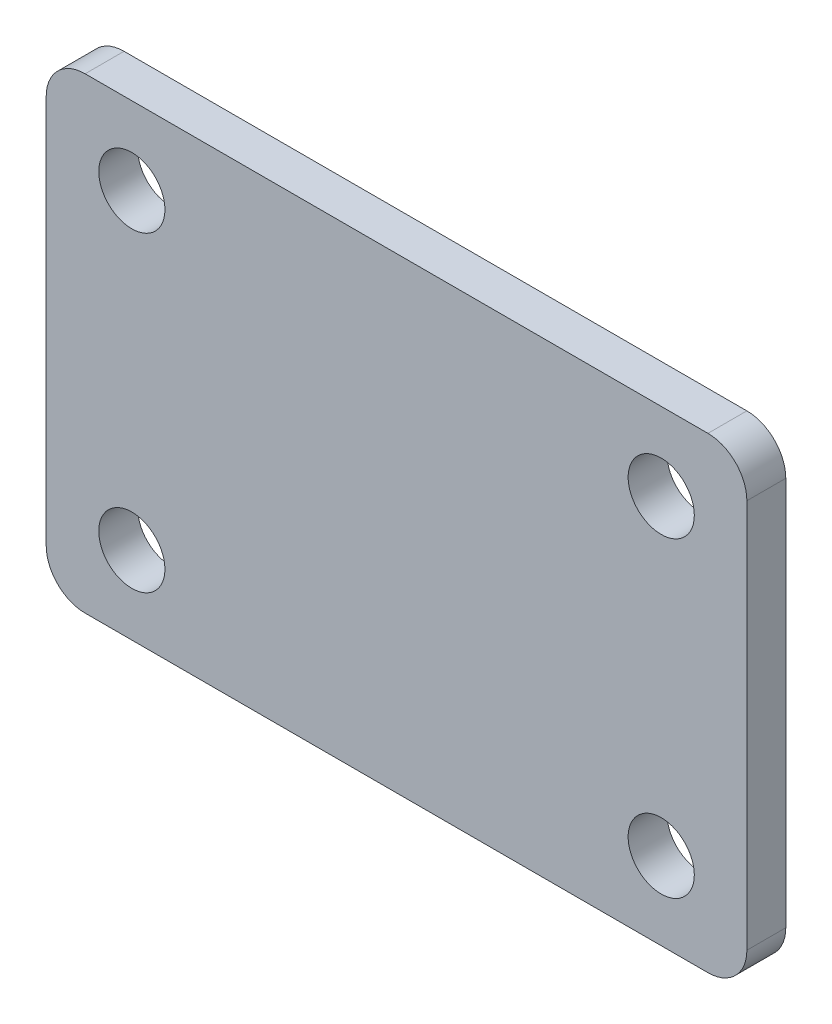
ISO-10303-21;
HEADER;
FILE_DESCRIPTION(('STEP AP214'),'2;1');
FILE_NAME('part.step','',(''),(''),'','','');
FILE_SCHEMA(('AUTOMOTIVE_DESIGN { 1 0 10303 214 1 1 1 1 }'));
ENDSEC;
DATA;
#1=APPLICATION_CONTEXT('core data for automotive mechanical design processes');
#2=APPLICATION_PROTOCOL_DEFINITION('international standard','automotive_design',2000,#1);
#3=PRODUCT_CONTEXT('',#1,'mechanical');
#4=PRODUCT('Part','Part','',(#3));
#5=PRODUCT_RELATED_PRODUCT_CATEGORY('part','',(#4));
#6=PRODUCT_DEFINITION_FORMATION('','',#4);
#7=PRODUCT_DEFINITION_CONTEXT('part definition',#1,'design');
#8=PRODUCT_DEFINITION('design','',#6,#7);
#9=PRODUCT_DEFINITION_SHAPE('','',#8);
#10=(LENGTH_UNIT() NAMED_UNIT(*) SI_UNIT(.MILLI.,.METRE.));
#11=(NAMED_UNIT(*) PLANE_ANGLE_UNIT() SI_UNIT($,.RADIAN.));
#12=(NAMED_UNIT(*) SI_UNIT($,.STERADIAN.) SOLID_ANGLE_UNIT());
#13=UNCERTAINTY_MEASURE_WITH_UNIT(LENGTH_MEASURE(1.E-05),#10,'distance_accuracy_value','');
#14=(GEOMETRIC_REPRESENTATION_CONTEXT(3) GLOBAL_UNCERTAINTY_ASSIGNED_CONTEXT((#13)) GLOBAL_UNIT_ASSIGNED_CONTEXT((#10,
#11,#12)) REPRESENTATION_CONTEXT('',''));
#15=CARTESIAN_POINT('',(0.,0.,0.));
#16=DIRECTION('',(0.,0.,1.));
#17=DIRECTION('',(1.,0.,0.));
#18=AXIS2_PLACEMENT_3D('',#15,#16,#17);
#19=CARTESIAN_POINT('',(-90.0000000000002,300.,-39.9999999999999));
#20=DIRECTION('',(0.999999999999998,0.,0.));
#21=DIRECTION('',(0.,1.,0.));
#22=AXIS2_PLACEMENT_3D('',#19,#20,#21);
#23=PLANE('',#22);
#24=DIRECTION('',(0.,-1.,0.));
#25=VECTOR('',#24,1.);
#26=CARTESIAN_POINT('',(-90.0000000000001,300.,-49.9999999999998));
#27=LINE('',#26,#25);
#28=CARTESIAN_POINT('',(-90.,290.,-49.9999999999998));
#29=VERTEX_POINT('',#28);
#30=CARTESIAN_POINT('',(-90.,190.,-49.9999999999998));
#31=VERTEX_POINT('',#30);
#32=EDGE_CURVE('E137',#29,#31,#27,.T.);
#33=ORIENTED_EDGE('',*,*,#32,.T.);
#34=DIRECTION('',(0.,0.,-1.));
#35=VECTOR('',#34,1.);
#36=CARTESIAN_POINT('',(-90.0000000000001,190.,-39.9999999999998));
#37=LINE('',#36,#35);
#38=CARTESIAN_POINT('',(-90.0000000000001,190.,-39.9999999999998));
#39=VERTEX_POINT('',#38);
#40=EDGE_CURVE('E112',#31,#39,#37,.F.);
#41=ORIENTED_EDGE('',*,*,#40,.T.);
#42=DIRECTION('',(0.,-1.,0.));
#43=VECTOR('',#42,1.);
#44=CARTESIAN_POINT('',(-90.0000000000002,300.,-39.9999999999999));
#45=LINE('',#44,#43);
#46=CARTESIAN_POINT('',(-89.9999999999999,290.,-40.));
#47=VERTEX_POINT('',#46);
#48=EDGE_CURVE('E151',#47,#39,#45,.T.);
#49=ORIENTED_EDGE('',*,*,#48,.F.);
#50=DIRECTION('',(0.,0.,-1.));
#51=VECTOR('',#50,1.);
#52=CARTESIAN_POINT('',(-89.9999999999999,290.,-40.));
#53=LINE('',#52,#51);
#54=EDGE_CURVE('E118',#47,#29,#53,.T.);
#55=ORIENTED_EDGE('',*,*,#54,.T.);
#56=EDGE_LOOP('',(#33,#41,#49,#55));
#57=FACE_BOUND('',#56,.T.);
#58=ADVANCED_FACE('F40',(#57),#23,.F.);
#59=CARTESIAN_POINT('',(-89.9999999999999,180.,-39.9999999999998));
#60=DIRECTION('',(0.,1.,0.));
#61=DIRECTION('',(0.,0.,1.));
#62=AXIS2_PLACEMENT_3D('',#59,#60,#61);
#63=PLANE('',#62);
#64=DIRECTION('',(0.999999999999998,0.,0.));
#65=VECTOR('',#64,1.);
#66=CARTESIAN_POINT('',(-89.9999999999999,180.,-39.9999999999998));
#67=LINE('',#66,#65);
#68=CARTESIAN_POINT('',(-80.,180.,-39.9999999999999));
#69=VERTEX_POINT('',#68);
#70=CARTESIAN_POINT('',(79.9999999999998,180.,-40.));
#71=VERTEX_POINT('',#70);
#72=EDGE_CURVE('E128',#69,#71,#67,.T.);
#73=ORIENTED_EDGE('',*,*,#72,.F.);
#74=DIRECTION('',(0.,0.,-1.));
#75=VECTOR('',#74,1.);
#76=CARTESIAN_POINT('',(-80.,180.,-39.9999999999999));
#77=LINE('',#76,#75);
#78=CARTESIAN_POINT('',(-79.9999999999998,180.,-49.9999999999998));
#79=VERTEX_POINT('',#78);
#80=EDGE_CURVE('E111',#69,#79,#77,.T.);
#81=ORIENTED_EDGE('',*,*,#80,.T.);
#82=DIRECTION('',(0.999999999999998,0.,0.));
#83=VECTOR('',#82,1.);
#84=CARTESIAN_POINT('',(-89.9999999999996,180.,-49.9999999999999));
#85=LINE('',#84,#83);
#86=CARTESIAN_POINT('',(80.,180.,-50.));
#87=VERTEX_POINT('',#86);
#88=EDGE_CURVE('E125',#79,#87,#85,.T.);
#89=ORIENTED_EDGE('',*,*,#88,.T.);
#90=DIRECTION('',(0.,0.,-1.));
#91=VECTOR('',#90,1.);
#92=CARTESIAN_POINT('',(79.9999999999998,180.,-40.));
#93=LINE('',#92,#91);
#94=EDGE_CURVE('E131',#87,#71,#93,.F.);
#95=ORIENTED_EDGE('',*,*,#94,.T.);
#96=EDGE_LOOP('',(#73,#81,#89,#95));
#97=FACE_BOUND('',#96,.T.);
#98=ADVANCED_FACE('F124',(#97),#63,.F.);
#99=CARTESIAN_POINT('',(89.9999999999996,300.,-39.9999999999999));
#100=DIRECTION('',(-0.999999999999998,0.,0.));
#101=DIRECTION('',(0.,-1.,0.));
#102=AXIS2_PLACEMENT_3D('',#99,#100,#101);
#103=PLANE('',#102);
#104=DIRECTION('',(0.,1.,0.));
#105=VECTOR('',#104,1.);
#106=CARTESIAN_POINT('',(89.9999999999996,300.,-39.9999999999999));
#107=LINE('',#106,#105);
#108=CARTESIAN_POINT('',(89.9999999999997,190.,-39.9999999999999));
#109=VERTEX_POINT('',#108);
#110=CARTESIAN_POINT('',(89.9999999999999,290.,-39.9999999999999));
#111=VERTEX_POINT('',#110);
#112=EDGE_CURVE('E190',#109,#111,#107,.T.);
#113=ORIENTED_EDGE('',*,*,#112,.F.);
#114=DIRECTION('',(0.,0.,-1.));
#115=VECTOR('',#114,1.);
#116=CARTESIAN_POINT('',(89.9999999999997,190.,-39.9999999999999));
#117=LINE('',#116,#115);
#118=CARTESIAN_POINT('',(89.9999999999993,190.,-49.9999999999998));
#119=VERTEX_POINT('',#118);
#120=EDGE_CURVE('E181',#109,#119,#117,.T.);
#121=ORIENTED_EDGE('',*,*,#120,.T.);
#122=DIRECTION('',(0.,1.,0.));
#123=VECTOR('',#122,1.);
#124=CARTESIAN_POINT('',(89.9999999999997,300.,-49.9999999999999));
#125=LINE('',#124,#123);
#126=CARTESIAN_POINT('',(90.,290.,-49.9999999999999));
#127=VERTEX_POINT('',#126);
#128=EDGE_CURVE('E136',#119,#127,#125,.T.);
#129=ORIENTED_EDGE('',*,*,#128,.T.);
#130=DIRECTION('',(0.,0.,-1.));
#131=VECTOR('',#130,1.);
#132=CARTESIAN_POINT('',(89.9999999999999,290.,-39.9999999999999));
#133=LINE('',#132,#131);
#134=EDGE_CURVE('E178',#127,#111,#133,.F.);
#135=ORIENTED_EDGE('',*,*,#134,.T.);
#136=EDGE_LOOP('',(#113,#121,#129,#135));
#137=FACE_BOUND('',#136,.T.);
#138=ADVANCED_FACE('F272',(#137),#103,.F.);
#139=CARTESIAN_POINT('',(-90.0000000000002,300.,-39.9999999999999));
#140=DIRECTION('',(0.,-1.,0.));
#141=DIRECTION('',(0.999999999999998,0.,0.));
#142=AXIS2_PLACEMENT_3D('',#139,#140,#141);
#143=PLANE('',#142);
#144=DIRECTION('',(-0.999999999999998,0.,0.));
#145=VECTOR('',#144,1.);
#146=CARTESIAN_POINT('',(-90.0000000000002,300.,-39.9999999999999));
#147=LINE('',#146,#145);
#148=CARTESIAN_POINT('',(79.9999999999995,300.,-40.));
#149=VERTEX_POINT('',#148);
#150=CARTESIAN_POINT('',(-80.0000000000001,300.,-39.9999999999999));
#151=VERTEX_POINT('',#150);
#152=EDGE_CURVE('E153',#149,#151,#147,.T.);
#153=ORIENTED_EDGE('',*,*,#152,.F.);
#154=DIRECTION('',(0.,0.,-1.));
#155=VECTOR('',#154,1.);
#156=CARTESIAN_POINT('',(79.9999999999996,300.,-39.9999999999999));
#157=LINE('',#156,#155);
#158=CARTESIAN_POINT('',(79.9999999999998,300.,-49.9999999999999));
#159=VERTEX_POINT('',#158);
#160=EDGE_CURVE('E11',#149,#159,#157,.T.);
#161=ORIENTED_EDGE('',*,*,#160,.T.);
#162=DIRECTION('',(-0.999999999999998,0.,0.));
#163=VECTOR('',#162,1.);
#164=CARTESIAN_POINT('',(-90.0000000000001,300.,-49.9999999999998));
#165=LINE('',#164,#163);
#166=CARTESIAN_POINT('',(-80.,300.,-50.));
#167=VERTEX_POINT('',#166);
#168=EDGE_CURVE('E142',#159,#167,#165,.T.);
#169=ORIENTED_EDGE('',*,*,#168,.T.);
#170=DIRECTION('',(0.,0.,-1.));
#171=VECTOR('',#170,1.);
#172=CARTESIAN_POINT('',(-80.0000000000001,300.,-39.9999999999999));
#173=LINE('',#172,#171);
#174=EDGE_CURVE('E49',#167,#151,#173,.F.);
#175=ORIENTED_EDGE('',*,*,#174,.T.);
#176=EDGE_LOOP('',(#153,#161,#169,#175));
#177=FACE_BOUND('',#176,.T.);
#178=ADVANCED_FACE('F253',(#177),#143,.F.);
#179=CARTESIAN_POINT('',(-4.44089209850063E-13,240.,-40.));
#180=DIRECTION('',(0.,0.,1.));
#181=DIRECTION('',(0.999999999999998,0.,0.));
#182=AXIS2_PLACEMENT_3D('',#179,#180,#181);
#183=PLANE('',#182);
#184=CARTESIAN_POINT('',(67.9999999999997,200.,-40.));
#185=DIRECTION('',(0.,0.,1.));
#186=DIRECTION('',(0.999999999999998,0.,0.));
#187=AXIS2_PLACEMENT_3D('',#184,#185,#186);
#188=CIRCLE('',#187,8.5);
#189=CARTESIAN_POINT('',(76.4999999999997,200.,-40.));
#190=VERTEX_POINT('',#189);
#191=EDGE_CURVE('E231',#190,#190,#188,.T.);
#192=ORIENTED_EDGE('',*,*,#191,.F.);
#193=EDGE_LOOP('',(#192));
#194=FACE_BOUND('',#193,.T.);
#195=CARTESIAN_POINT('',(-68.0000000000001,200.,-39.9999999999998));
#196=DIRECTION('',(0.,0.,1.));
#197=DIRECTION('',(0.999999999999998,0.,0.));
#198=AXIS2_PLACEMENT_3D('',#195,#196,#197);
#199=CIRCLE('',#198,8.5);
#200=CARTESIAN_POINT('',(-59.5000000000001,200.,-39.9999999999998));
#201=VERTEX_POINT('',#200);
#202=EDGE_CURVE('E221',#201,#201,#199,.T.);
#203=ORIENTED_EDGE('',*,*,#202,.F.);
#204=EDGE_LOOP('',(#203));
#205=FACE_BOUND('',#204,.T.);
#206=CARTESIAN_POINT('',(67.9999999999997,280.,-39.9999999999998));
#207=DIRECTION('',(0.,0.,1.));
#208=DIRECTION('',(0.999999999999998,0.,0.));
#209=AXIS2_PLACEMENT_3D('',#206,#207,#208);
#210=CIRCLE('',#209,8.5);
#211=CARTESIAN_POINT('',(76.4999999999997,280.,-39.9999999999998));
#212=VERTEX_POINT('',#211);
#213=EDGE_CURVE('E211',#212,#212,#210,.T.);
#214=ORIENTED_EDGE('',*,*,#213,.F.);
#215=EDGE_LOOP('',(#214));
#216=FACE_BOUND('',#215,.T.);
#217=CARTESIAN_POINT('',(-68.0000000000002,280.,-40.));
#218=DIRECTION('',(0.,0.,1.));
#219=DIRECTION('',(0.999999999999998,0.,0.));
#220=AXIS2_PLACEMENT_3D('',#217,#218,#219);
#221=CIRCLE('',#220,8.5);
#222=CARTESIAN_POINT('',(-59.5000000000002,280.,-40.));
#223=VERTEX_POINT('',#222);
#224=EDGE_CURVE('E201',#223,#223,#221,.T.);
#225=ORIENTED_EDGE('',*,*,#224,.F.);
#226=EDGE_LOOP('',(#225));
#227=FACE_BOUND('',#226,.T.);
#228=ORIENTED_EDGE('',*,*,#48,.T.);
#229=CARTESIAN_POINT('',(-80.,190.,-39.9999999999999));
#230=DIRECTION('',(0.,0.,1.));
#231=DIRECTION('',(0.999999999999998,0.,0.));
#232=AXIS2_PLACEMENT_3D('',#229,#230,#231);
#233=CIRCLE('',#232,10.);
#234=EDGE_CURVE('E175',#39,#69,#233,.T.);
#235=ORIENTED_EDGE('',*,*,#234,.T.);
#236=ORIENTED_EDGE('',*,*,#72,.T.);
#237=CARTESIAN_POINT('',(79.9999999999995,190.,-39.9999999999997));
#238=DIRECTION('',(0.,0.,1.));
#239=DIRECTION('',(0.999999999999998,0.,0.));
#240=AXIS2_PLACEMENT_3D('',#237,#238,#239);
#241=CIRCLE('',#240,10.);
#242=EDGE_CURVE('E172',#71,#109,#241,.T.);
#243=ORIENTED_EDGE('',*,*,#242,.T.);
#244=ORIENTED_EDGE('',*,*,#112,.T.);
#245=CARTESIAN_POINT('',(79.9999999999995,290.,-40.0000000000001));
#246=DIRECTION('',(0.,0.,1.));
#247=DIRECTION('',(0.999999999999998,0.,0.));
#248=AXIS2_PLACEMENT_3D('',#245,#246,#247);
#249=CIRCLE('',#248,10.);
#250=EDGE_CURVE('E62',#111,#149,#249,.T.);
#251=ORIENTED_EDGE('',*,*,#250,.T.);
#252=ORIENTED_EDGE('',*,*,#152,.T.);
#253=CARTESIAN_POINT('',(-80.0000000000001,290.,-39.9999999999998));
#254=DIRECTION('',(0.,0.,1.));
#255=DIRECTION('',(0.999999999999998,0.,0.));
#256=AXIS2_PLACEMENT_3D('',#253,#254,#255);
#257=CIRCLE('',#256,10.);
#258=EDGE_CURVE('E167',#151,#47,#257,.T.);
#259=ORIENTED_EDGE('',*,*,#258,.T.);
#260=EDGE_LOOP('',(#228,#235,#236,#243,#244,#251,#252,#259));
#261=FACE_BOUND('',#260,.T.);
#262=ADVANCED_FACE('F250',(#194,#205,#216,#227,#261),#183,.T.);
#263=CARTESIAN_POINT('',(-5.55111512312578E-13,240.,-49.9999999999997));
#264=DIRECTION('',(0.,0.,1.));
#265=DIRECTION('',(0.999999999999998,0.,0.));
#266=AXIS2_PLACEMENT_3D('',#263,#264,#265);
#267=PLANE('',#266);
#268=CARTESIAN_POINT('',(67.9999999999999,200.,-49.9999999999999));
#269=DIRECTION('',(0.,0.,1.));
#270=DIRECTION('',(0.999999999999998,0.,0.));
#271=AXIS2_PLACEMENT_3D('',#268,#269,#270);
#272=CIRCLE('',#271,8.5);
#273=CARTESIAN_POINT('',(76.4999999999999,200.,-49.9999999999999));
#274=VERTEX_POINT('',#273);
#275=EDGE_CURVE('E225',#274,#274,#272,.T.);
#276=ORIENTED_EDGE('',*,*,#275,.T.);
#277=EDGE_LOOP('',(#276));
#278=FACE_BOUND('',#277,.T.);
#279=CARTESIAN_POINT('',(-67.9999999999999,200.,-49.9999999999998));
#280=DIRECTION('',(0.,0.,1.));
#281=DIRECTION('',(0.999999999999998,0.,0.));
#282=AXIS2_PLACEMENT_3D('',#279,#280,#281);
#283=CIRCLE('',#282,8.5);
#284=CARTESIAN_POINT('',(-59.5,200.,-49.9999999999998));
#285=VERTEX_POINT('',#284);
#286=EDGE_CURVE('E215',#285,#285,#283,.T.);
#287=ORIENTED_EDGE('',*,*,#286,.T.);
#288=EDGE_LOOP('',(#287));
#289=FACE_BOUND('',#288,.T.);
#290=CARTESIAN_POINT('',(67.9999999999998,280.,-49.9999999999998));
#291=DIRECTION('',(0.,0.,1.));
#292=DIRECTION('',(0.999999999999998,0.,0.));
#293=AXIS2_PLACEMENT_3D('',#290,#291,#292);
#294=CIRCLE('',#293,8.5);
#295=CARTESIAN_POINT('',(76.4999999999998,280.,-49.9999999999998));
#296=VERTEX_POINT('',#295);
#297=EDGE_CURVE('E205',#296,#296,#294,.T.);
#298=ORIENTED_EDGE('',*,*,#297,.T.);
#299=EDGE_LOOP('',(#298));
#300=FACE_BOUND('',#299,.T.);
#301=CARTESIAN_POINT('',(-68.0000000000001,280.,-49.9999999999999));
#302=DIRECTION('',(0.,0.,1.));
#303=DIRECTION('',(0.999999999999998,0.,0.));
#304=AXIS2_PLACEMENT_3D('',#301,#302,#303);
#305=CIRCLE('',#304,8.5);
#306=CARTESIAN_POINT('',(-59.5000000000001,280.,-49.9999999999999));
#307=VERTEX_POINT('',#306);
#308=EDGE_CURVE('E145',#307,#307,#305,.T.);
#309=ORIENTED_EDGE('',*,*,#308,.T.);
#310=EDGE_LOOP('',(#309));
#311=FACE_BOUND('',#310,.T.);
#312=ORIENTED_EDGE('',*,*,#88,.F.);
#313=CARTESIAN_POINT('',(-80.0000000000004,190.,-49.9999999999998));
#314=DIRECTION('',(0.,0.,1.));
#315=DIRECTION('',(0.999999999999998,0.,0.));
#316=AXIS2_PLACEMENT_3D('',#313,#314,#315);
#317=CIRCLE('',#316,10.);
#318=EDGE_CURVE('E107',#79,#31,#317,.F.);
#319=ORIENTED_EDGE('',*,*,#318,.T.);
#320=ORIENTED_EDGE('',*,*,#32,.F.);
#321=CARTESIAN_POINT('',(-80.,290.,-49.9999999999998));
#322=DIRECTION('',(0.,0.,1.));
#323=DIRECTION('',(0.999999999999998,0.,0.));
#324=AXIS2_PLACEMENT_3D('',#321,#322,#323);
#325=CIRCLE('',#324,10.);
#326=EDGE_CURVE('E130',#29,#167,#325,.F.);
#327=ORIENTED_EDGE('',*,*,#326,.T.);
#328=ORIENTED_EDGE('',*,*,#168,.F.);
#329=CARTESIAN_POINT('',(80.,290.,-50.0000000000001));
#330=DIRECTION('',(0.,0.,1.));
#331=DIRECTION('',(0.999999999999998,0.,0.));
#332=AXIS2_PLACEMENT_3D('',#329,#330,#331);
#333=CIRCLE('',#332,10.);
#334=EDGE_CURVE('E157',#159,#127,#333,.F.);
#335=ORIENTED_EDGE('',*,*,#334,.T.);
#336=ORIENTED_EDGE('',*,*,#128,.F.);
#337=CARTESIAN_POINT('',(80.,190.,-49.9999999999998));
#338=DIRECTION('',(0.,0.,1.));
#339=DIRECTION('',(0.999999999999998,0.,0.));
#340=AXIS2_PLACEMENT_3D('',#337,#338,#339);
#341=CIRCLE('',#340,10.);
#342=EDGE_CURVE('E119',#119,#87,#341,.F.);
#343=ORIENTED_EDGE('',*,*,#342,.T.);
#344=EDGE_LOOP('',(#312,#319,#320,#327,#328,#335,#336,#343));
#345=FACE_BOUND('',#344,.T.);
#346=ADVANCED_FACE('F133',(#278,#289,#300,#311,#345),#267,.F.);
#347=CARTESIAN_POINT('',(-68.0000000000001,280.,-49.9999999999999));
#348=DIRECTION('',(0.,0.,1.));
#349=DIRECTION('',(0.999999999999998,0.,0.));
#350=AXIS2_PLACEMENT_3D('',#347,#348,#349);
#351=CYLINDRICAL_SURFACE('',#350,8.5);
#352=ORIENTED_EDGE('',*,*,#308,.F.);
#353=EDGE_LOOP('',(#352));
#354=FACE_BOUND('',#353,.T.);
#355=ORIENTED_EDGE('',*,*,#224,.T.);
#356=EDGE_LOOP('',(#355));
#357=FACE_BOUND('',#356,.T.);
#358=ADVANCED_FACE('F296',(#354,#357),#351,.F.);
#359=CARTESIAN_POINT('',(67.9999999999998,280.,-49.9999999999998));
#360=DIRECTION('',(0.,0.,1.));
#361=DIRECTION('',(0.999999999999998,0.,0.));
#362=AXIS2_PLACEMENT_3D('',#359,#360,#361);
#363=CYLINDRICAL_SURFACE('',#362,8.5);
#364=ORIENTED_EDGE('',*,*,#297,.F.);
#365=EDGE_LOOP('',(#364));
#366=FACE_BOUND('',#365,.T.);
#367=ORIENTED_EDGE('',*,*,#213,.T.);
#368=EDGE_LOOP('',(#367));
#369=FACE_BOUND('',#368,.T.);
#370=ADVANCED_FACE('F300',(#366,#369),#363,.F.);
#371=CARTESIAN_POINT('',(-67.9999999999999,200.,-49.9999999999998));
#372=DIRECTION('',(0.,0.,1.));
#373=DIRECTION('',(0.999999999999998,0.,0.));
#374=AXIS2_PLACEMENT_3D('',#371,#372,#373);
#375=CYLINDRICAL_SURFACE('',#374,8.5);
#376=ORIENTED_EDGE('',*,*,#286,.F.);
#377=EDGE_LOOP('',(#376));
#378=FACE_BOUND('',#377,.T.);
#379=ORIENTED_EDGE('',*,*,#202,.T.);
#380=EDGE_LOOP('',(#379));
#381=FACE_BOUND('',#380,.T.);
#382=ADVANCED_FACE('F246',(#378,#381),#375,.F.);
#383=CARTESIAN_POINT('',(67.9999999999999,200.,-49.9999999999999));
#384=DIRECTION('',(0.,0.,1.));
#385=DIRECTION('',(0.999999999999998,0.,0.));
#386=AXIS2_PLACEMENT_3D('',#383,#384,#385);
#387=CYLINDRICAL_SURFACE('',#386,8.5);
#388=ORIENTED_EDGE('',*,*,#275,.F.);
#389=EDGE_LOOP('',(#388));
#390=FACE_BOUND('',#389,.T.);
#391=ORIENTED_EDGE('',*,*,#191,.T.);
#392=EDGE_LOOP('',(#391));
#393=FACE_BOUND('',#392,.T.);
#394=ADVANCED_FACE('F243',(#390,#393),#387,.F.);
#395=CARTESIAN_POINT('',(-80.,190.,-39.9999999999999));
#396=DIRECTION('',(0.,0.,-1.));
#397=DIRECTION('',(-0.999999999999998,0.,0.));
#398=AXIS2_PLACEMENT_3D('',#395,#396,#397);
#399=CYLINDRICAL_SURFACE('',#398,10.);
#400=ORIENTED_EDGE('',*,*,#234,.F.);
#401=ORIENTED_EDGE('',*,*,#40,.F.);
#402=ORIENTED_EDGE('',*,*,#318,.F.);
#403=ORIENTED_EDGE('',*,*,#80,.F.);
#404=EDGE_LOOP('',(#400,#401,#402,#403));
#405=FACE_BOUND('',#404,.T.);
#406=ADVANCED_FACE('F110',(#405),#399,.T.);
#407=CARTESIAN_POINT('',(79.9999999999995,190.,-39.9999999999997));
#408=DIRECTION('',(0.,0.,-1.));
#409=DIRECTION('',(-0.999999999999998,0.,0.));
#410=AXIS2_PLACEMENT_3D('',#407,#408,#409);
#411=CYLINDRICAL_SURFACE('',#410,10.);
#412=ORIENTED_EDGE('',*,*,#242,.F.);
#413=ORIENTED_EDGE('',*,*,#94,.F.);
#414=ORIENTED_EDGE('',*,*,#342,.F.);
#415=ORIENTED_EDGE('',*,*,#120,.F.);
#416=EDGE_LOOP('',(#412,#413,#414,#415));
#417=FACE_BOUND('',#416,.T.);
#418=ADVANCED_FACE('F276',(#417),#411,.T.);
#419=CARTESIAN_POINT('',(79.9999999999995,290.,-40.0000000000001));
#420=DIRECTION('',(0.,0.,-1.));
#421=DIRECTION('',(-0.999999999999998,0.,0.));
#422=AXIS2_PLACEMENT_3D('',#419,#420,#421);
#423=CYLINDRICAL_SURFACE('',#422,10.);
#424=ORIENTED_EDGE('',*,*,#250,.F.);
#425=ORIENTED_EDGE('',*,*,#134,.F.);
#426=ORIENTED_EDGE('',*,*,#334,.F.);
#427=ORIENTED_EDGE('',*,*,#160,.F.);
#428=EDGE_LOOP('',(#424,#425,#426,#427));
#429=FACE_BOUND('',#428,.T.);
#430=ADVANCED_FACE('F268',(#429),#423,.T.);
#431=CARTESIAN_POINT('',(-80.0000000000001,290.,-39.9999999999998));
#432=DIRECTION('',(0.,0.,-1.));
#433=DIRECTION('',(-0.999999999999998,0.,0.));
#434=AXIS2_PLACEMENT_3D('',#431,#432,#433);
#435=CYLINDRICAL_SURFACE('',#434,10.);
#436=ORIENTED_EDGE('',*,*,#258,.F.);
#437=ORIENTED_EDGE('',*,*,#174,.F.);
#438=ORIENTED_EDGE('',*,*,#326,.F.);
#439=ORIENTED_EDGE('',*,*,#54,.F.);
#440=EDGE_LOOP('',(#436,#437,#438,#439));
#441=FACE_BOUND('',#440,.T.);
#442=ADVANCED_FACE('F42',(#441),#435,.T.);
#443=CLOSED_SHELL('',(#58,#98,#138,#178,#262,#346,#358,#370,#382,#394,#406,#418,#430,#442));
#444=MANIFOLD_SOLID_BREP('B2',#443);
#445=ADVANCED_BREP_SHAPE_REPRESENTATION('',(#18,#444),#14);
#446=SHAPE_DEFINITION_REPRESENTATION(#9,#445);
ENDSEC;
END-ISO-10303-21;
